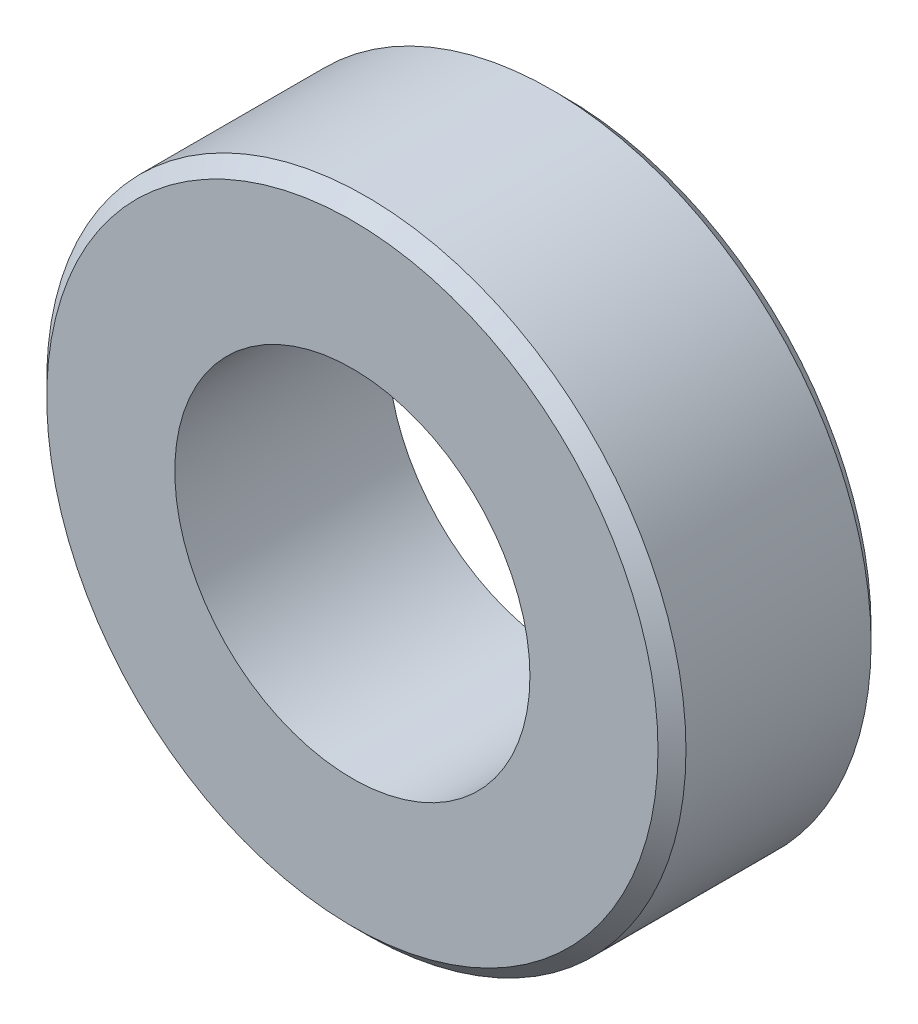
ISO-10303-21;
HEADER;
FILE_DESCRIPTION(('STEP AP214'),'2;1');
FILE_NAME('part.step','',(''),(''),'','','');
FILE_SCHEMA(('AUTOMOTIVE_DESIGN { 1 0 10303 214 1 1 1 1 }'));
ENDSEC;
DATA;
#1=APPLICATION_CONTEXT('core data for automotive mechanical design processes');
#2=APPLICATION_PROTOCOL_DEFINITION('international standard','automotive_design',2000,#1);
#3=PRODUCT_CONTEXT('',#1,'mechanical');
#4=PRODUCT('Part','Part','',(#3));
#5=PRODUCT_RELATED_PRODUCT_CATEGORY('part','',(#4));
#6=PRODUCT_DEFINITION_FORMATION('','',#4);
#7=PRODUCT_DEFINITION_CONTEXT('part definition',#1,'design');
#8=PRODUCT_DEFINITION('design','',#6,#7);
#9=PRODUCT_DEFINITION_SHAPE('','',#8);
#10=(LENGTH_UNIT() NAMED_UNIT(*) SI_UNIT(.MILLI.,.METRE.));
#11=(NAMED_UNIT(*) PLANE_ANGLE_UNIT() SI_UNIT($,.RADIAN.));
#12=(NAMED_UNIT(*) SI_UNIT($,.STERADIAN.) SOLID_ANGLE_UNIT());
#13=UNCERTAINTY_MEASURE_WITH_UNIT(LENGTH_MEASURE(1.E-05),#10,'distance_accuracy_value','');
#14=(GEOMETRIC_REPRESENTATION_CONTEXT(3) GLOBAL_UNCERTAINTY_ASSIGNED_CONTEXT((#13)) GLOBAL_UNIT_ASSIGNED_CONTEXT((#10,
#11,#12)) REPRESENTATION_CONTEXT('',''));
#15=CARTESIAN_POINT('',(0.,0.,0.));
#16=DIRECTION('',(0.,0.,1.));
#17=DIRECTION('',(1.,0.,0.));
#18=AXIS2_PLACEMENT_3D('',#15,#16,#17);
#19=CARTESIAN_POINT('',(0.,0.,7.62));
#20=DIRECTION('',(0.,0.,0.999999999999997));
#21=DIRECTION('',(0.999999999999999,0.,0.));
#22=AXIS2_PLACEMENT_3D('',#19,#20,#21);
#23=PLANE('',#22);
#24=CARTESIAN_POINT('',(0.,0.,7.62));
#25=DIRECTION('',(0.,0.,0.999999999999997));
#26=DIRECTION('',(0.999999999999999,0.,0.));
#27=AXIS2_PLACEMENT_3D('',#24,#25,#26);
#28=CIRCLE('',#27,10.93);
#29=CARTESIAN_POINT('',(10.93,0.,7.62000000000001));
#30=VERTEX_POINT('',#29);
#31=EDGE_CURVE('E12',#30,#30,#28,.T.);
#32=ORIENTED_EDGE('',*,*,#31,.T.);
#33=EDGE_LOOP('',(#32));
#34=FACE_BOUND('',#33,.T.);
#35=CARTESIAN_POINT('',(0.,0.,7.62));
#36=DIRECTION('',(0.,0.,0.999999999999997));
#37=DIRECTION('',(0.999999999999999,0.,0.));
#38=AXIS2_PLACEMENT_3D('',#35,#36,#37);
#39=CIRCLE('',#38,6.35);
#40=CARTESIAN_POINT('',(6.34999999999999,0.,7.62000000000001));
#41=VERTEX_POINT('',#40);
#42=EDGE_CURVE('E75',#41,#41,#39,.T.);
#43=ORIENTED_EDGE('',*,*,#42,.F.);
#44=EDGE_LOOP('',(#43));
#45=FACE_BOUND('',#44,.T.);
#46=ADVANCED_FACE('F48',(#34,#45),#23,.T.);
#47=CARTESIAN_POINT('',(0.,0.,0.));
#48=DIRECTION('',(0.,0.,0.999999999999997));
#49=DIRECTION('',(0.999999999999999,0.,0.));
#50=AXIS2_PLACEMENT_3D('',#47,#48,#49);
#51=PLANE('',#50);
#52=CARTESIAN_POINT('',(0.,0.,0.));
#53=DIRECTION('',(0.,0.,0.999999999999997));
#54=DIRECTION('',(0.999999999999999,0.,0.));
#55=AXIS2_PLACEMENT_3D('',#52,#53,#54);
#56=CIRCLE('',#55,10.93);
#57=CARTESIAN_POINT('',(10.93,0.,0.));
#58=VERTEX_POINT('',#57);
#59=EDGE_CURVE('E57',#58,#58,#56,.F.);
#60=ORIENTED_EDGE('',*,*,#59,.T.);
#61=EDGE_LOOP('',(#60));
#62=FACE_BOUND('',#61,.T.);
#63=CARTESIAN_POINT('',(0.,0.,0.));
#64=DIRECTION('',(0.,0.,0.999999999999997));
#65=DIRECTION('',(0.999999999999999,0.,0.));
#66=AXIS2_PLACEMENT_3D('',#63,#64,#65);
#67=CIRCLE('',#66,6.35);
#68=CARTESIAN_POINT('',(6.34999999999999,0.,0.));
#69=VERTEX_POINT('',#68);
#70=EDGE_CURVE('E76',#69,#69,#67,.T.);
#71=ORIENTED_EDGE('',*,*,#70,.T.);
#72=EDGE_LOOP('',(#71));
#73=FACE_BOUND('',#72,.T.);
#74=ADVANCED_FACE('F89',(#62,#73),#51,.F.);
#75=CARTESIAN_POINT('',(0.,0.,7.62));
#76=DIRECTION('',(0.,0.,-0.999999999999997));
#77=DIRECTION('',(-0.999999999999999,0.,0.));
#78=AXIS2_PLACEMENT_3D('',#75,#76,#77);
#79=CYLINDRICAL_SURFACE('',#78,11.43);
#80=CARTESIAN_POINT('',(0.,0.,0.499999999999997));
#81=DIRECTION('',(0.,0.,0.999999999999997));
#82=DIRECTION('',(0.999999999999999,0.,0.));
#83=AXIS2_PLACEMENT_3D('',#80,#81,#82);
#84=CIRCLE('',#83,11.43);
#85=CARTESIAN_POINT('',(11.43,0.,0.500000000000005));
#86=VERTEX_POINT('',#85);
#87=EDGE_CURVE('E63',#86,#86,#84,.T.);
#88=ORIENTED_EDGE('',*,*,#87,.T.);
#89=EDGE_LOOP('',(#88));
#90=FACE_BOUND('',#89,.T.);
#91=CARTESIAN_POINT('',(0.,0.,7.12));
#92=DIRECTION('',(0.,0.,0.999999999999997));
#93=DIRECTION('',(0.999999999999999,0.,0.));
#94=AXIS2_PLACEMENT_3D('',#91,#92,#93);
#95=CIRCLE('',#94,11.43);
#96=CARTESIAN_POINT('',(11.43,0.,7.12000000000001));
#97=VERTEX_POINT('',#96);
#98=EDGE_CURVE('E69',#97,#97,#95,.F.);
#99=ORIENTED_EDGE('',*,*,#98,.T.);
#100=EDGE_LOOP('',(#99));
#101=FACE_BOUND('',#100,.T.);
#102=ADVANCED_FACE('F94',(#90,#101),#79,.T.);
#103=CARTESIAN_POINT('',(0.,0.,7.62));
#104=DIRECTION('',(0.,0.,-0.999999999999997));
#105=DIRECTION('',(-0.999999999999999,0.,0.));
#106=AXIS2_PLACEMENT_3D('',#103,#104,#105);
#107=CYLINDRICAL_SURFACE('',#106,6.35);
#108=ORIENTED_EDGE('',*,*,#42,.T.);
#109=EDGE_LOOP('',(#108));
#110=FACE_BOUND('',#109,.T.);
#111=ORIENTED_EDGE('',*,*,#70,.F.);
#112=EDGE_LOOP('',(#111));
#113=FACE_BOUND('',#112,.T.);
#114=ADVANCED_FACE('F85',(#110,#113),#107,.F.);
#115=CARTESIAN_POINT('',(0.,0.,0.499999999999997));
#116=DIRECTION('',(0.,0.,0.999999999999997));
#117=DIRECTION('',(0.999999999999999,0.,0.));
#118=AXIS2_PLACEMENT_3D('',#115,#116,#117);
#119=CONICAL_SURFACE('',#118,11.43,0.78539816339745);
#120=ORIENTED_EDGE('',*,*,#59,.F.);
#121=EDGE_LOOP('',(#120));
#122=FACE_BOUND('',#121,.T.);
#123=ORIENTED_EDGE('',*,*,#87,.F.);
#124=EDGE_LOOP('',(#123));
#125=FACE_BOUND('',#124,.T.);
#126=ADVANCED_FACE('F101',(#122,#125),#119,.T.);
#127=CARTESIAN_POINT('',(0.,0.,7.62));
#128=DIRECTION('',(0.,0.,-0.999999999999997));
#129=DIRECTION('',(-0.999999999999999,0.,0.));
#130=AXIS2_PLACEMENT_3D('',#127,#128,#129);
#131=CONICAL_SURFACE('',#130,10.93,0.785398163397445);
#132=ORIENTED_EDGE('',*,*,#98,.F.);
#133=EDGE_LOOP('',(#132));
#134=FACE_BOUND('',#133,.T.);
#135=ORIENTED_EDGE('',*,*,#31,.F.);
#136=EDGE_LOOP('',(#135));
#137=FACE_BOUND('',#136,.T.);
#138=ADVANCED_FACE('F51',(#134,#137),#131,.T.);
#139=CLOSED_SHELL('',(#46,#74,#102,#114,#126,#138));
#140=MANIFOLD_SOLID_BREP('B2',#139);
#141=ADVANCED_BREP_SHAPE_REPRESENTATION('',(#18,#140),#14);
#142=SHAPE_DEFINITION_REPRESENTATION(#9,#141);
ENDSEC;
END-ISO-10303-21;
